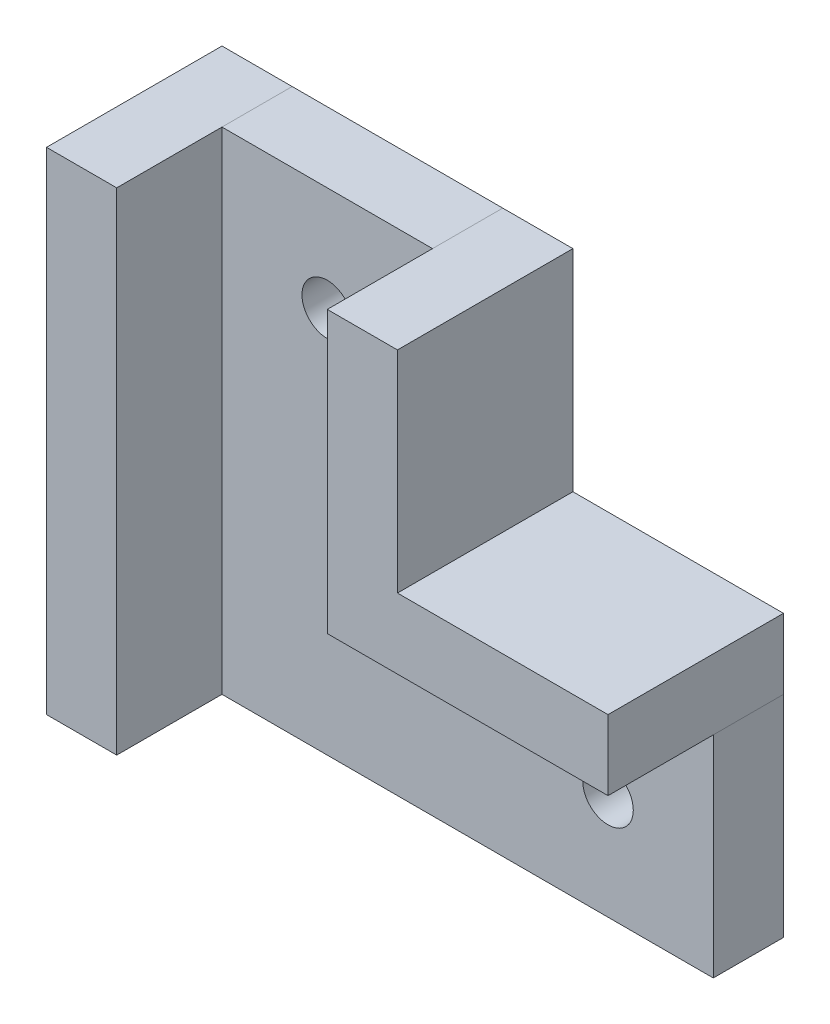
ISO-10303-21;
HEADER;
FILE_DESCRIPTION(('STEP AP214'),'2;1');
FILE_NAME('part.step','',(''),(''),'','','');
FILE_SCHEMA(('AUTOMOTIVE_DESIGN { 1 0 10303 214 1 1 1 1 }'));
ENDSEC;
DATA;
#1=APPLICATION_CONTEXT('core data for automotive mechanical design processes');
#2=APPLICATION_PROTOCOL_DEFINITION('international standard','automotive_design',2000,#1);
#3=PRODUCT_CONTEXT('',#1,'mechanical');
#4=PRODUCT('Part','Part','',(#3));
#5=PRODUCT_RELATED_PRODUCT_CATEGORY('part','',(#4));
#6=PRODUCT_DEFINITION_FORMATION('','',#4);
#7=PRODUCT_DEFINITION_CONTEXT('part definition',#1,'design');
#8=PRODUCT_DEFINITION('design','',#6,#7);
#9=PRODUCT_DEFINITION_SHAPE('','',#8);
#10=(LENGTH_UNIT() NAMED_UNIT(*) SI_UNIT(.MILLI.,.METRE.));
#11=(NAMED_UNIT(*) PLANE_ANGLE_UNIT() SI_UNIT($,.RADIAN.));
#12=(NAMED_UNIT(*) SI_UNIT($,.STERADIAN.) SOLID_ANGLE_UNIT());
#13=UNCERTAINTY_MEASURE_WITH_UNIT(LENGTH_MEASURE(1.E-05),#10,'distance_accuracy_value','');
#14=(GEOMETRIC_REPRESENTATION_CONTEXT(3) GLOBAL_UNCERTAINTY_ASSIGNED_CONTEXT((#13)) GLOBAL_UNIT_ASSIGNED_CONTEXT((#10,
#11,#12)) REPRESENTATION_CONTEXT('',''));
#15=CARTESIAN_POINT('',(0.,0.,0.));
#16=DIRECTION('',(0.,0.,1.));
#17=DIRECTION('',(1.,0.,0.));
#18=AXIS2_PLACEMENT_3D('',#15,#16,#17);
#19=CARTESIAN_POINT('',(-7.52988047808764,-25.8067729083665,12.5));
#20=DIRECTION('',(1.,0.,0.));
#21=DIRECTION('',(0.,1.,0.));
#22=AXIS2_PLACEMENT_3D('',#19,#20,#21);
#23=PLANE('',#22);
#24=DIRECTION('',(0.,-1.,0.));
#25=VECTOR('',#24,1.);
#26=CARTESIAN_POINT('',(-7.52988047808764,-25.8067729083665,0.));
#27=LINE('',#26,#25);
#28=CARTESIAN_POINT('',(-7.52988047808764,9.19322709163348,0.));
#29=VERTEX_POINT('',#28);
#30=CARTESIAN_POINT('',(-7.52988047808764,-25.8067729083665,0.));
#31=VERTEX_POINT('',#30);
#32=EDGE_CURVE('E114',#29,#31,#27,.T.);
#33=ORIENTED_EDGE('',*,*,#32,.F.);
#34=DIRECTION('',(0.,0.,-1.));
#35=VECTOR('',#34,1.);
#36=CARTESIAN_POINT('',(-7.52988047808764,9.19322709163348,12.5));
#37=LINE('',#36,#35);
#38=CARTESIAN_POINT('',(-7.52988047808764,9.19322709163348,12.5));
#39=VERTEX_POINT('',#38);
#40=EDGE_CURVE('E12',#39,#29,#37,.T.);
#41=ORIENTED_EDGE('',*,*,#40,.F.);
#42=DIRECTION('',(0.,-1.,0.));
#43=VECTOR('',#42,1.);
#44=CARTESIAN_POINT('',(-7.52988047808764,-25.8067729083665,12.5));
#45=LINE('',#44,#43);
#46=CARTESIAN_POINT('',(-7.52988047808764,-25.8067729083665,12.5));
#47=VERTEX_POINT('',#46);
#48=EDGE_CURVE('E108',#39,#47,#45,.T.);
#49=ORIENTED_EDGE('',*,*,#48,.T.);
#50=DIRECTION('',(0.,0.,-1.));
#51=VECTOR('',#50,1.);
#52=CARTESIAN_POINT('',(-7.52988047808764,-25.8067729083665,12.5));
#53=LINE('',#52,#51);
#54=EDGE_CURVE('E53',#47,#31,#53,.T.);
#55=ORIENTED_EDGE('',*,*,#54,.T.);
#56=EDGE_LOOP('',(#33,#41,#49,#55));
#57=FACE_BOUND('',#56,.T.);
#58=ADVANCED_FACE('F50',(#57),#23,.T.);
#59=CARTESIAN_POINT('',(-7.52988047808764,9.19322709163348,12.5));
#60=DIRECTION('',(0.,1.,0.));
#61=DIRECTION('',(0.,0.,1.));
#62=AXIS2_PLACEMENT_3D('',#59,#60,#61);
#63=PLANE('',#62);
#64=DIRECTION('',(1.,0.,0.));
#65=VECTOR('',#64,1.);
#66=CARTESIAN_POINT('',(-7.52988047808764,9.19322709163348,0.));
#67=LINE('',#66,#65);
#68=CARTESIAN_POINT('',(-12.5298804780876,9.19322709163348,0.));
#69=VERTEX_POINT('',#68);
#70=EDGE_CURVE('E110',#69,#29,#67,.T.);
#71=ORIENTED_EDGE('',*,*,#70,.F.);
#72=DIRECTION('',(0.,0.,-1.));
#73=VECTOR('',#72,1.);
#74=CARTESIAN_POINT('',(-12.5298804780876,9.19322709163348,12.5));
#75=LINE('',#74,#73);
#76=CARTESIAN_POINT('',(-12.5298804780876,9.19322709163348,12.5));
#77=VERTEX_POINT('',#76);
#78=EDGE_CURVE('E59',#77,#69,#75,.T.);
#79=ORIENTED_EDGE('',*,*,#78,.F.);
#80=DIRECTION('',(1.,0.,0.));
#81=VECTOR('',#80,1.);
#82=CARTESIAN_POINT('',(-7.52988047808764,9.19322709163348,12.5));
#83=LINE('',#82,#81);
#84=EDGE_CURVE('E105',#77,#39,#83,.T.);
#85=ORIENTED_EDGE('',*,*,#84,.T.);
#86=ORIENTED_EDGE('',*,*,#40,.T.);
#87=EDGE_LOOP('',(#71,#79,#85,#86));
#88=FACE_BOUND('',#87,.T.);
#89=ADVANCED_FACE('F124',(#88),#63,.T.);
#90=CARTESIAN_POINT('',(-12.5298804780876,-25.8067729083665,12.5));
#91=DIRECTION('',(-1.,0.,0.));
#92=DIRECTION('',(0.,0.,1.));
#93=AXIS2_PLACEMENT_3D('',#90,#91,#92);
#94=PLANE('',#93);
#95=DIRECTION('',(0.,1.,0.));
#96=VECTOR('',#95,1.);
#97=CARTESIAN_POINT('',(-12.5298804780876,-25.8067729083665,0.));
#98=LINE('',#97,#96);
#99=CARTESIAN_POINT('',(-12.5298804780876,-25.8067729083665,0.));
#100=VERTEX_POINT('',#99);
#101=EDGE_CURVE('E100',#100,#69,#98,.T.);
#102=ORIENTED_EDGE('',*,*,#101,.F.);
#103=DIRECTION('',(0.,0.,-1.));
#104=VECTOR('',#103,1.);
#105=CARTESIAN_POINT('',(-12.5298804780876,-25.8067729083665,12.5));
#106=LINE('',#105,#104);
#107=CARTESIAN_POINT('',(-12.5298804780876,-25.8067729083665,12.5));
#108=VERTEX_POINT('',#107);
#109=EDGE_CURVE('E95',#108,#100,#106,.T.);
#110=ORIENTED_EDGE('',*,*,#109,.F.);
#111=DIRECTION('',(0.,1.,0.));
#112=VECTOR('',#111,1.);
#113=CARTESIAN_POINT('',(-12.5298804780876,-25.8067729083665,12.5));
#114=LINE('',#113,#112);
#115=EDGE_CURVE('E98',#108,#77,#114,.T.);
#116=ORIENTED_EDGE('',*,*,#115,.T.);
#117=ORIENTED_EDGE('',*,*,#78,.T.);
#118=EDGE_LOOP('',(#102,#110,#116,#117));
#119=FACE_BOUND('',#118,.T.);
#120=ADVANCED_FACE('F97',(#119),#94,.T.);
#121=CARTESIAN_POINT('',(-7.52988047808764,-25.8067729083665,12.5));
#122=DIRECTION('',(0.,-1.,0.));
#123=DIRECTION('',(0.,0.,-1.));
#124=AXIS2_PLACEMENT_3D('',#121,#122,#123);
#125=PLANE('',#124);
#126=DIRECTION('',(-1.,0.,0.));
#127=VECTOR('',#126,1.);
#128=CARTESIAN_POINT('',(-7.52988047808764,-25.8067729083665,0.));
#129=LINE('',#128,#127);
#130=EDGE_CURVE('E117',#31,#100,#129,.T.);
#131=ORIENTED_EDGE('',*,*,#130,.F.);
#132=ORIENTED_EDGE('',*,*,#54,.F.);
#133=DIRECTION('',(-1.,0.,0.));
#134=VECTOR('',#133,1.);
#135=CARTESIAN_POINT('',(-7.52988047808764,-25.8067729083665,12.5));
#136=LINE('',#135,#134);
#137=EDGE_CURVE('E104',#47,#108,#136,.T.);
#138=ORIENTED_EDGE('',*,*,#137,.T.);
#139=ORIENTED_EDGE('',*,*,#109,.T.);
#140=EDGE_LOOP('',(#131,#132,#138,#139));
#141=FACE_BOUND('',#140,.T.);
#142=ADVANCED_FACE('F107',(#141),#125,.T.);
#143=CARTESIAN_POINT('',(0.,0.,12.5));
#144=DIRECTION('',(0.,0.,1.));
#145=DIRECTION('',(1.,0.,0.));
#146=AXIS2_PLACEMENT_3D('',#143,#144,#145);
#147=PLANE('',#146);
#148=ORIENTED_EDGE('',*,*,#48,.F.);
#149=ORIENTED_EDGE('',*,*,#84,.F.);
#150=ORIENTED_EDGE('',*,*,#115,.F.);
#151=ORIENTED_EDGE('',*,*,#137,.F.);
#152=EDGE_LOOP('',(#148,#149,#150,#151));
#153=FACE_BOUND('',#152,.T.);
#154=ADVANCED_FACE('F103',(#153),#147,.T.);
#155=CARTESIAN_POINT('',(0.,0.,0.));
#156=DIRECTION('',(0.,0.,1.));
#157=DIRECTION('',(1.,0.,0.));
#158=AXIS2_PLACEMENT_3D('',#155,#156,#157);
#159=PLANE('',#158);
#160=ORIENTED_EDGE('',*,*,#32,.T.);
#161=ORIENTED_EDGE('',*,*,#130,.T.);
#162=ORIENTED_EDGE('',*,*,#101,.T.);
#163=ORIENTED_EDGE('',*,*,#70,.T.);
#164=EDGE_LOOP('',(#160,#161,#162,#163));
#165=FACE_BOUND('',#164,.T.);
#166=ADVANCED_FACE('F123',(#165),#159,.F.);
#167=CLOSED_SHELL('',(#58,#89,#120,#142,#154,#166));
#168=MANIFOLD_SOLID_BREP('B2',#167);
#169=CARTESIAN_POINT('',(7.47011952191236,-10.8067729083665,12.5));
#170=DIRECTION('',(-1.,0.,0.));
#171=DIRECTION('',(0.,-1.,0.));
#172=AXIS2_PLACEMENT_3D('',#169,#170,#171);
#173=PLANE('',#172);
#174=DIRECTION('',(0.,1.,0.));
#175=VECTOR('',#174,1.);
#176=CARTESIAN_POINT('',(7.47011952191236,-10.8067729083665,0.));
#177=LINE('',#176,#175);
#178=CARTESIAN_POINT('',(7.47011952191236,-10.8067729083665,0.));
#179=VERTEX_POINT('',#178);
#180=CARTESIAN_POINT('',(7.47011952191236,9.19322709163348,0.));
#181=VERTEX_POINT('',#180);
#182=EDGE_CURVE('E268',#179,#181,#177,.T.);
#183=ORIENTED_EDGE('',*,*,#182,.F.);
#184=DIRECTION('',(0.,0.,-1.));
#185=VECTOR('',#184,1.);
#186=CARTESIAN_POINT('',(7.47011952191236,-10.8067729083665,12.5));
#187=LINE('',#186,#185);
#188=CARTESIAN_POINT('',(7.47011952191236,-10.8067729083665,12.5));
#189=VERTEX_POINT('',#188);
#190=EDGE_CURVE('E48',#189,#179,#187,.T.);
#191=ORIENTED_EDGE('',*,*,#190,.F.);
#192=DIRECTION('',(0.,1.,0.));
#193=VECTOR('',#192,1.);
#194=CARTESIAN_POINT('',(7.47011952191236,-10.8067729083665,12.5));
#195=LINE('',#194,#193);
#196=CARTESIAN_POINT('',(7.47011952191236,9.19322709163348,12.5));
#197=VERTEX_POINT('',#196);
#198=EDGE_CURVE('E282',#189,#197,#195,.T.);
#199=ORIENTED_EDGE('',*,*,#198,.T.);
#200=DIRECTION('',(0.,0.,-1.));
#201=VECTOR('',#200,1.);
#202=CARTESIAN_POINT('',(7.47011952191236,9.19322709163348,12.5));
#203=LINE('',#202,#201);
#204=EDGE_CURVE('E186',#197,#181,#203,.T.);
#205=ORIENTED_EDGE('',*,*,#204,.T.);
#206=EDGE_LOOP('',(#183,#191,#199,#205));
#207=FACE_BOUND('',#206,.T.);
#208=ADVANCED_FACE('F183',(#207),#173,.T.);
#209=CARTESIAN_POINT('',(27.4701195219124,-10.8067729083665,12.5));
#210=DIRECTION('',(0.,-1.,0.));
#211=DIRECTION('',(1.,0.,0.));
#212=AXIS2_PLACEMENT_3D('',#209,#210,#211);
#213=PLANE('',#212);
#214=DIRECTION('',(-1.,0.,0.));
#215=VECTOR('',#214,1.);
#216=CARTESIAN_POINT('',(27.4701195219124,-10.8067729083665,0.));
#217=LINE('',#216,#215);
#218=CARTESIAN_POINT('',(27.4701195219124,-10.8067729083665,0.));
#219=VERTEX_POINT('',#218);
#220=EDGE_CURVE('E280',#219,#179,#217,.T.);
#221=ORIENTED_EDGE('',*,*,#220,.F.);
#222=DIRECTION('',(0.,0.,-1.));
#223=VECTOR('',#222,1.);
#224=CARTESIAN_POINT('',(27.4701195219124,-10.8067729083665,12.5));
#225=LINE('',#224,#223);
#226=CARTESIAN_POINT('',(27.4701195219124,-10.8067729083665,12.5));
#227=VERTEX_POINT('',#226);
#228=EDGE_CURVE('E192',#227,#219,#225,.T.);
#229=ORIENTED_EDGE('',*,*,#228,.F.);
#230=DIRECTION('',(-1.,0.,0.));
#231=VECTOR('',#230,1.);
#232=CARTESIAN_POINT('',(27.4701195219124,-10.8067729083665,12.5));
#233=LINE('',#232,#231);
#234=EDGE_CURVE('E258',#227,#189,#233,.T.);
#235=ORIENTED_EDGE('',*,*,#234,.T.);
#236=ORIENTED_EDGE('',*,*,#190,.T.);
#237=EDGE_LOOP('',(#221,#229,#235,#236));
#238=FACE_BOUND('',#237,.T.);
#239=ADVANCED_FACE('F290',(#238),#213,.T.);
#240=CARTESIAN_POINT('',(27.4701195219124,-10.8067729083665,12.5));
#241=DIRECTION('',(1.,0.,0.));
#242=DIRECTION('',(0.,0.,-1.));
#243=AXIS2_PLACEMENT_3D('',#240,#241,#242);
#244=PLANE('',#243);
#245=DIRECTION('',(0.,-1.,0.));
#246=VECTOR('',#245,1.);
#247=CARTESIAN_POINT('',(27.4701195219124,-10.8067729083665,0.));
#248=LINE('',#247,#246);
#249=CARTESIAN_POINT('',(27.4701195219124,-5.80677290836653,0.));
#250=VERTEX_POINT('',#249);
#251=EDGE_CURVE('E245',#250,#219,#248,.T.);
#252=ORIENTED_EDGE('',*,*,#251,.F.);
#253=DIRECTION('',(0.,0.,-1.));
#254=VECTOR('',#253,1.);
#255=CARTESIAN_POINT('',(27.4701195219124,-5.80677290836653,12.5));
#256=LINE('',#255,#254);
#257=CARTESIAN_POINT('',(27.4701195219124,-5.80677290836653,12.5));
#258=VERTEX_POINT('',#257);
#259=EDGE_CURVE('E240',#258,#250,#256,.T.);
#260=ORIENTED_EDGE('',*,*,#259,.F.);
#261=DIRECTION('',(0.,-1.,0.));
#262=VECTOR('',#261,1.);
#263=CARTESIAN_POINT('',(27.4701195219124,-10.8067729083665,12.5));
#264=LINE('',#263,#262);
#265=EDGE_CURVE('E243',#258,#227,#264,.T.);
#266=ORIENTED_EDGE('',*,*,#265,.T.);
#267=ORIENTED_EDGE('',*,*,#228,.T.);
#268=EDGE_LOOP('',(#252,#260,#266,#267));
#269=FACE_BOUND('',#268,.T.);
#270=ADVANCED_FACE('F242',(#269),#244,.T.);
#271=CARTESIAN_POINT('',(12.4701195219124,-5.80677290836653,12.5));
#272=DIRECTION('',(0.,1.,0.));
#273=DIRECTION('',(-1.,0.,0.));
#274=AXIS2_PLACEMENT_3D('',#271,#272,#273);
#275=PLANE('',#274);
#276=DIRECTION('',(1.,0.,0.));
#277=VECTOR('',#276,1.);
#278=CARTESIAN_POINT('',(12.4701195219124,-5.80677290836653,0.));
#279=LINE('',#278,#277);
#280=CARTESIAN_POINT('',(12.4701195219124,-5.80677290836653,0.));
#281=VERTEX_POINT('',#280);
#282=EDGE_CURVE('E277',#281,#250,#279,.T.);
#283=ORIENTED_EDGE('',*,*,#282,.F.);
#284=DIRECTION('',(0.,0.,-1.));
#285=VECTOR('',#284,1.);
#286=CARTESIAN_POINT('',(12.4701195219124,-5.80677290836653,12.5));
#287=LINE('',#286,#285);
#288=CARTESIAN_POINT('',(12.4701195219124,-5.80677290836653,12.5));
#289=VERTEX_POINT('',#288);
#290=EDGE_CURVE('E250',#289,#281,#287,.T.);
#291=ORIENTED_EDGE('',*,*,#290,.F.);
#292=DIRECTION('',(1.,0.,0.));
#293=VECTOR('',#292,1.);
#294=CARTESIAN_POINT('',(12.4701195219124,-5.80677290836653,12.5));
#295=LINE('',#294,#293);
#296=EDGE_CURVE('E256',#289,#258,#295,.T.);
#297=ORIENTED_EDGE('',*,*,#296,.T.);
#298=ORIENTED_EDGE('',*,*,#259,.T.);
#299=EDGE_LOOP('',(#283,#291,#297,#298));
#300=FACE_BOUND('',#299,.T.);
#301=ADVANCED_FACE('F260',(#300),#275,.T.);
#302=CARTESIAN_POINT('',(12.4701195219124,9.19322709163348,12.5));
#303=DIRECTION('',(1.,0.,0.));
#304=DIRECTION('',(0.,1.,0.));
#305=AXIS2_PLACEMENT_3D('',#302,#303,#304);
#306=PLANE('',#305);
#307=DIRECTION('',(0.,-1.,0.));
#308=VECTOR('',#307,1.);
#309=CARTESIAN_POINT('',(12.4701195219124,9.19322709163348,0.));
#310=LINE('',#309,#308);
#311=CARTESIAN_POINT('',(12.4701195219124,9.19322709163348,0.));
#312=VERTEX_POINT('',#311);
#313=EDGE_CURVE('E274',#312,#281,#310,.T.);
#314=ORIENTED_EDGE('',*,*,#313,.F.);
#315=DIRECTION('',(0.,0.,-1.));
#316=VECTOR('',#315,1.);
#317=CARTESIAN_POINT('',(12.4701195219124,9.19322709163348,12.5));
#318=LINE('',#317,#316);
#319=CARTESIAN_POINT('',(12.4701195219124,9.19322709163348,12.5));
#320=VERTEX_POINT('',#319);
#321=EDGE_CURVE('E285',#320,#312,#318,.T.);
#322=ORIENTED_EDGE('',*,*,#321,.F.);
#323=DIRECTION('',(0.,-1.,0.));
#324=VECTOR('',#323,1.);
#325=CARTESIAN_POINT('',(12.4701195219124,9.19322709163348,12.5));
#326=LINE('',#325,#324);
#327=EDGE_CURVE('E261',#320,#289,#326,.T.);
#328=ORIENTED_EDGE('',*,*,#327,.T.);
#329=ORIENTED_EDGE('',*,*,#290,.T.);
#330=EDGE_LOOP('',(#314,#322,#328,#329));
#331=FACE_BOUND('',#330,.T.);
#332=ADVANCED_FACE('F303',(#331),#306,.T.);
#333=CARTESIAN_POINT('',(7.47011952191236,9.19322709163348,12.5));
#334=DIRECTION('',(0.,1.,0.));
#335=DIRECTION('',(0.,0.,1.));
#336=AXIS2_PLACEMENT_3D('',#333,#334,#335);
#337=PLANE('',#336);
#338=DIRECTION('',(1.,0.,0.));
#339=VECTOR('',#338,1.);
#340=CARTESIAN_POINT('',(7.47011952191236,9.19322709163348,0.));
#341=LINE('',#340,#339);
#342=EDGE_CURVE('E271',#181,#312,#341,.T.);
#343=ORIENTED_EDGE('',*,*,#342,.F.);
#344=ORIENTED_EDGE('',*,*,#204,.F.);
#345=DIRECTION('',(1.,0.,0.));
#346=VECTOR('',#345,1.);
#347=CARTESIAN_POINT('',(7.47011952191236,9.19322709163348,12.5));
#348=LINE('',#347,#346);
#349=EDGE_CURVE('E263',#197,#320,#348,.T.);
#350=ORIENTED_EDGE('',*,*,#349,.T.);
#351=ORIENTED_EDGE('',*,*,#321,.T.);
#352=EDGE_LOOP('',(#343,#344,#350,#351));
#353=FACE_BOUND('',#352,.T.);
#354=ADVANCED_FACE('F287',(#353),#337,.T.);
#355=CARTESIAN_POINT('',(0.,0.,12.5));
#356=DIRECTION('',(0.,0.,-1.));
#357=DIRECTION('',(-1.,0.,0.));
#358=AXIS2_PLACEMENT_3D('',#355,#356,#357);
#359=PLANE('',#358);
#360=ORIENTED_EDGE('',*,*,#198,.F.);
#361=ORIENTED_EDGE('',*,*,#234,.F.);
#362=ORIENTED_EDGE('',*,*,#265,.F.);
#363=ORIENTED_EDGE('',*,*,#296,.F.);
#364=ORIENTED_EDGE('',*,*,#327,.F.);
#365=ORIENTED_EDGE('',*,*,#349,.F.);
#366=EDGE_LOOP('',(#360,#361,#362,#363,#364,#365));
#367=FACE_BOUND('',#366,.T.);
#368=ADVANCED_FACE('F254',(#367),#359,.F.);
#369=CARTESIAN_POINT('',(0.,0.,0.));
#370=DIRECTION('',(0.,0.,-1.));
#371=DIRECTION('',(-1.,0.,0.));
#372=AXIS2_PLACEMENT_3D('',#369,#370,#371);
#373=PLANE('',#372);
#374=ORIENTED_EDGE('',*,*,#182,.T.);
#375=ORIENTED_EDGE('',*,*,#342,.T.);
#376=ORIENTED_EDGE('',*,*,#313,.T.);
#377=ORIENTED_EDGE('',*,*,#282,.T.);
#378=ORIENTED_EDGE('',*,*,#251,.T.);
#379=ORIENTED_EDGE('',*,*,#220,.T.);
#380=EDGE_LOOP('',(#374,#375,#376,#377,#378,#379));
#381=FACE_BOUND('',#380,.T.);
#382=ADVANCED_FACE('F289',(#381),#373,.T.);
#383=CLOSED_SHELL('',(#208,#239,#270,#301,#332,#354,#368,#382));
#384=MANIFOLD_SOLID_BREP('B6',#383);
#385=CARTESIAN_POINT('',(-7.52988047808764,9.19322709163348,5.));
#386=DIRECTION('',(1.,0.,0.));
#387=DIRECTION('',(0.,1.,0.));
#388=AXIS2_PLACEMENT_3D('',#385,#386,#387);
#389=PLANE('',#388);
#390=DIRECTION('',(0.,-1.,0.));
#391=VECTOR('',#390,1.);
#392=CARTESIAN_POINT('',(-7.52988047808764,9.19322709163348,0.));
#393=LINE('',#392,#391);
#394=CARTESIAN_POINT('',(-7.52988047808764,9.19322709163348,0.));
#395=VERTEX_POINT('',#394);
#396=CARTESIAN_POINT('',(-7.52988047808764,-25.8067729083665,0.));
#397=VERTEX_POINT('',#396);
#398=EDGE_CURVE('E448',#395,#397,#393,.T.);
#399=ORIENTED_EDGE('',*,*,#398,.T.);
#400=DIRECTION('',(0.,0.,-1.));
#401=VECTOR('',#400,1.);
#402=CARTESIAN_POINT('',(-7.52988047808764,-25.8067729083665,5.));
#403=LINE('',#402,#401);
#404=CARTESIAN_POINT('',(-7.52988047808764,-25.8067729083665,5.));
#405=VERTEX_POINT('',#404);
#406=EDGE_CURVE('E181',#405,#397,#403,.T.);
#407=ORIENTED_EDGE('',*,*,#406,.F.);
#408=DIRECTION('',(0.,-1.,0.));
#409=VECTOR('',#408,1.);
#410=CARTESIAN_POINT('',(-7.52988047808764,9.19322709163348,5.));
#411=LINE('',#410,#409);
#412=CARTESIAN_POINT('',(-7.52988047808764,9.19322709163348,5.));
#413=VERTEX_POINT('',#412);
#414=EDGE_CURVE('E465',#413,#405,#411,.T.);
#415=ORIENTED_EDGE('',*,*,#414,.F.);
#416=DIRECTION('',(0.,0.,-1.));
#417=VECTOR('',#416,1.);
#418=CARTESIAN_POINT('',(-7.52988047808764,9.19322709163348,5.));
#419=LINE('',#418,#417);
#420=EDGE_CURVE('E444',#413,#395,#419,.T.);
#421=ORIENTED_EDGE('',*,*,#420,.T.);
#422=EDGE_LOOP('',(#399,#407,#415,#421));
#423=FACE_BOUND('',#422,.T.);
#424=ADVANCED_FACE('F359',(#423),#389,.F.);
#425=CARTESIAN_POINT('',(-7.52988047808764,-25.8067729083665,5.));
#426=DIRECTION('',(0.,1.,0.));
#427=DIRECTION('',(0.,0.,1.));
#428=AXIS2_PLACEMENT_3D('',#425,#426,#427);
#429=PLANE('',#428);
#430=DIRECTION('',(1.,0.,0.));
#431=VECTOR('',#430,1.);
#432=CARTESIAN_POINT('',(-7.52988047808764,-25.8067729083665,0.));
#433=LINE('',#432,#431);
#434=CARTESIAN_POINT('',(27.4701195219124,-25.8067729083665,0.));
#435=VERTEX_POINT('',#434);
#436=EDGE_CURVE('E452',#397,#435,#433,.T.);
#437=ORIENTED_EDGE('',*,*,#436,.T.);
#438=DIRECTION('',(0.,0.,-1.));
#439=VECTOR('',#438,1.);
#440=CARTESIAN_POINT('',(27.4701195219124,-25.8067729083665,5.));
#441=LINE('',#440,#439);
#442=CARTESIAN_POINT('',(27.4701195219124,-25.8067729083665,5.));
#443=VERTEX_POINT('',#442);
#444=EDGE_CURVE('E368',#443,#435,#441,.T.);
#445=ORIENTED_EDGE('',*,*,#444,.F.);
#446=DIRECTION('',(1.,0.,0.));
#447=VECTOR('',#446,1.);
#448=CARTESIAN_POINT('',(-7.52988047808764,-25.8067729083665,5.));
#449=LINE('',#448,#447);
#450=EDGE_CURVE('E413',#405,#443,#449,.T.);
#451=ORIENTED_EDGE('',*,*,#450,.F.);
#452=ORIENTED_EDGE('',*,*,#406,.T.);
#453=EDGE_LOOP('',(#437,#445,#451,#452));
#454=FACE_BOUND('',#453,.T.);
#455=ADVANCED_FACE('F494',(#454),#429,.F.);
#456=CARTESIAN_POINT('',(27.4701195219124,-25.8067729083665,5.));
#457=DIRECTION('',(-1.,0.,0.));
#458=DIRECTION('',(0.,0.,1.));
#459=AXIS2_PLACEMENT_3D('',#456,#457,#458);
#460=PLANE('',#459);
#461=DIRECTION('',(0.,1.,0.));
#462=VECTOR('',#461,1.);
#463=CARTESIAN_POINT('',(27.4701195219124,-25.8067729083665,0.));
#464=LINE('',#463,#462);
#465=CARTESIAN_POINT('',(27.4701195219124,-10.8067729083665,0.));
#466=VERTEX_POINT('',#465);
#467=EDGE_CURVE('E456',#435,#466,#464,.T.);
#468=ORIENTED_EDGE('',*,*,#467,.T.);
#469=DIRECTION('',(0.,0.,-1.));
#470=VECTOR('',#469,1.);
#471=CARTESIAN_POINT('',(27.4701195219124,-10.8067729083665,5.));
#472=LINE('',#471,#470);
#473=CARTESIAN_POINT('',(27.4701195219124,-10.8067729083665,5.));
#474=VERTEX_POINT('',#473);
#475=EDGE_CURVE('E437',#474,#466,#472,.T.);
#476=ORIENTED_EDGE('',*,*,#475,.F.);
#477=DIRECTION('',(0.,1.,0.));
#478=VECTOR('',#477,1.);
#479=CARTESIAN_POINT('',(27.4701195219124,-25.8067729083665,5.));
#480=LINE('',#479,#478);
#481=EDGE_CURVE('E426',#443,#474,#480,.T.);
#482=ORIENTED_EDGE('',*,*,#481,.F.);
#483=ORIENTED_EDGE('',*,*,#444,.T.);
#484=EDGE_LOOP('',(#468,#476,#482,#483));
#485=FACE_BOUND('',#484,.T.);
#486=ADVANCED_FACE('F475',(#485),#460,.F.);
#487=CARTESIAN_POINT('',(27.4701195219124,-10.8067729083665,5.));
#488=DIRECTION('',(0.,-1.,0.));
#489=DIRECTION('',(1.,0.,0.));
#490=AXIS2_PLACEMENT_3D('',#487,#488,#489);
#491=PLANE('',#490);
#492=DIRECTION('',(-1.,0.,0.));
#493=VECTOR('',#492,1.);
#494=CARTESIAN_POINT('',(27.4701195219124,-10.8067729083665,0.));
#495=LINE('',#494,#493);
#496=CARTESIAN_POINT('',(7.47011952191236,-10.8067729083665,0.));
#497=VERTEX_POINT('',#496);
#498=EDGE_CURVE('E435',#466,#497,#495,.T.);
#499=ORIENTED_EDGE('',*,*,#498,.T.);
#500=DIRECTION('',(0.,0.,-1.));
#501=VECTOR('',#500,1.);
#502=CARTESIAN_POINT('',(7.47011952191236,-10.8067729083665,5.));
#503=LINE('',#502,#501);
#504=CARTESIAN_POINT('',(7.47011952191236,-10.8067729083665,5.));
#505=VERTEX_POINT('',#504);
#506=EDGE_CURVE('E432',#505,#497,#503,.T.);
#507=ORIENTED_EDGE('',*,*,#506,.F.);
#508=DIRECTION('',(-1.,0.,0.));
#509=VECTOR('',#508,1.);
#510=CARTESIAN_POINT('',(27.4701195219124,-10.8067729083665,5.));
#511=LINE('',#510,#509);
#512=EDGE_CURVE('E420',#474,#505,#511,.T.);
#513=ORIENTED_EDGE('',*,*,#512,.F.);
#514=ORIENTED_EDGE('',*,*,#475,.T.);
#515=EDGE_LOOP('',(#499,#507,#513,#514));
#516=FACE_BOUND('',#515,.T.);
#517=ADVANCED_FACE('F433',(#516),#491,.F.);
#518=CARTESIAN_POINT('',(7.47011952191236,9.19322709163348,5.));
#519=DIRECTION('',(-1.,0.,0.));
#520=DIRECTION('',(0.,-1.,0.));
#521=AXIS2_PLACEMENT_3D('',#518,#519,#520);
#522=PLANE('',#521);
#523=DIRECTION('',(0.,1.,0.));
#524=VECTOR('',#523,1.);
#525=CARTESIAN_POINT('',(7.47011952191236,9.19322709163348,0.));
#526=LINE('',#525,#524);
#527=CARTESIAN_POINT('',(7.47011952191236,9.19322709163348,0.));
#528=VERTEX_POINT('',#527);
#529=EDGE_CURVE('E399',#497,#528,#526,.T.);
#530=ORIENTED_EDGE('',*,*,#529,.T.);
#531=DIRECTION('',(0.,0.,-1.));
#532=VECTOR('',#531,1.);
#533=CARTESIAN_POINT('',(7.47011952191236,9.19322709163348,5.));
#534=LINE('',#533,#532);
#535=CARTESIAN_POINT('',(7.47011952191236,9.19322709163348,5.));
#536=VERTEX_POINT('',#535);
#537=EDGE_CURVE('E438',#536,#528,#534,.T.);
#538=ORIENTED_EDGE('',*,*,#537,.F.);
#539=DIRECTION('',(0.,1.,0.));
#540=VECTOR('',#539,1.);
#541=CARTESIAN_POINT('',(7.47011952191236,9.19322709163348,5.));
#542=LINE('',#541,#540);
#543=EDGE_CURVE('E424',#505,#536,#542,.T.);
#544=ORIENTED_EDGE('',*,*,#543,.F.);
#545=ORIENTED_EDGE('',*,*,#506,.T.);
#546=EDGE_LOOP('',(#530,#538,#544,#545));
#547=FACE_BOUND('',#546,.T.);
#548=ADVANCED_FACE('F440',(#547),#522,.F.);
#549=CARTESIAN_POINT('',(-7.52988047808764,9.19322709163348,5.));
#550=DIRECTION('',(0.,-1.,0.));
#551=DIRECTION('',(0.,0.,-1.));
#552=AXIS2_PLACEMENT_3D('',#549,#550,#551);
#553=PLANE('',#552);
#554=DIRECTION('',(-1.,0.,0.));
#555=VECTOR('',#554,1.);
#556=CARTESIAN_POINT('',(-7.52988047808764,9.19322709163348,0.));
#557=LINE('',#556,#555);
#558=EDGE_CURVE('E405',#528,#395,#557,.T.);
#559=ORIENTED_EDGE('',*,*,#558,.T.);
#560=ORIENTED_EDGE('',*,*,#420,.F.);
#561=DIRECTION('',(-1.,0.,0.));
#562=VECTOR('',#561,1.);
#563=CARTESIAN_POINT('',(-7.52988047808764,9.19322709163348,5.));
#564=LINE('',#563,#562);
#565=EDGE_CURVE('E376',#536,#413,#564,.T.);
#566=ORIENTED_EDGE('',*,*,#565,.F.);
#567=ORIENTED_EDGE('',*,*,#537,.T.);
#568=EDGE_LOOP('',(#559,#560,#566,#567));
#569=FACE_BOUND('',#568,.T.);
#570=ADVANCED_FACE('F482',(#569),#553,.F.);
#571=CARTESIAN_POINT('',(0.,0.,5.));
#572=DIRECTION('',(0.,0.,1.));
#573=DIRECTION('',(1.,0.,0.));
#574=AXIS2_PLACEMENT_3D('',#571,#572,#573);
#575=PLANE('',#574);
#576=CARTESIAN_POINT('',(-0.0298804780876419,1.69322709163348,5.));
#577=DIRECTION('',(0.,0.,1.));
#578=DIRECTION('',(1.,0.,0.));
#579=AXIS2_PLACEMENT_3D('',#576,#577,#578);
#580=CIRCLE('',#579,1.8);
#581=CARTESIAN_POINT('',(1.77011952191236,1.69322709163348,5.));
#582=VERTEX_POINT('',#581);
#583=EDGE_CURVE('E453',#582,#582,#580,.T.);
#584=ORIENTED_EDGE('',*,*,#583,.F.);
#585=EDGE_LOOP('',(#584));
#586=FACE_BOUND('',#585,.T.);
#587=CARTESIAN_POINT('',(19.9701195219124,-18.3067729083665,5.));
#588=DIRECTION('',(0.,0.,1.));
#589=DIRECTION('',(1.,0.,0.));
#590=AXIS2_PLACEMENT_3D('',#587,#588,#589);
#591=CIRCLE('',#590,1.8);
#592=CARTESIAN_POINT('',(21.7701195219124,-18.3067729083665,5.));
#593=VERTEX_POINT('',#592);
#594=EDGE_CURVE('E561',#593,#593,#591,.T.);
#595=ORIENTED_EDGE('',*,*,#594,.F.);
#596=EDGE_LOOP('',(#595));
#597=FACE_BOUND('',#596,.T.);
#598=ORIENTED_EDGE('',*,*,#414,.T.);
#599=ORIENTED_EDGE('',*,*,#450,.T.);
#600=ORIENTED_EDGE('',*,*,#481,.T.);
#601=ORIENTED_EDGE('',*,*,#512,.T.);
#602=ORIENTED_EDGE('',*,*,#543,.T.);
#603=ORIENTED_EDGE('',*,*,#565,.T.);
#604=EDGE_LOOP('',(#598,#599,#600,#601,#602,#603));
#605=FACE_BOUND('',#604,.T.);
#606=ADVANCED_FACE('F422',(#586,#597,#605),#575,.T.);
#607=CARTESIAN_POINT('',(0.,0.,0.));
#608=DIRECTION('',(0.,0.,1.));
#609=DIRECTION('',(1.,0.,0.));
#610=AXIS2_PLACEMENT_3D('',#607,#608,#609);
#611=PLANE('',#610);
#612=CARTESIAN_POINT('',(-0.0298804780876419,1.69322709163348,0.));
#613=DIRECTION('',(0.,0.,-1.));
#614=DIRECTION('',(-1.,0.,0.));
#615=AXIS2_PLACEMENT_3D('',#612,#613,#614);
#616=CIRCLE('',#615,1.8);
#617=CARTESIAN_POINT('',(-1.82988047808764,1.69322709163348,0.));
#618=VERTEX_POINT('',#617);
#619=EDGE_CURVE('E559',#618,#618,#616,.T.);
#620=ORIENTED_EDGE('',*,*,#619,.F.);
#621=EDGE_LOOP('',(#620));
#622=FACE_BOUND('',#621,.T.);
#623=CARTESIAN_POINT('',(19.9701195219124,-18.3067729083665,0.));
#624=DIRECTION('',(0.,0.,-1.));
#625=DIRECTION('',(-1.,0.,0.));
#626=AXIS2_PLACEMENT_3D('',#623,#624,#625);
#627=CIRCLE('',#626,1.8);
#628=CARTESIAN_POINT('',(18.1701195219124,-18.3067729083665,0.));
#629=VERTEX_POINT('',#628);
#630=EDGE_CURVE('E562',#629,#629,#627,.T.);
#631=ORIENTED_EDGE('',*,*,#630,.F.);
#632=EDGE_LOOP('',(#631));
#633=FACE_BOUND('',#632,.T.);
#634=ORIENTED_EDGE('',*,*,#398,.F.);
#635=ORIENTED_EDGE('',*,*,#558,.F.);
#636=ORIENTED_EDGE('',*,*,#529,.F.);
#637=ORIENTED_EDGE('',*,*,#498,.F.);
#638=ORIENTED_EDGE('',*,*,#467,.F.);
#639=ORIENTED_EDGE('',*,*,#436,.F.);
#640=EDGE_LOOP('',(#634,#635,#636,#637,#638,#639));
#641=FACE_BOUND('',#640,.T.);
#642=ADVANCED_FACE('F478',(#622,#633,#641),#611,.F.);
#643=CARTESIAN_POINT('',(19.9701195219124,-18.3067729083665,12.5));
#644=DIRECTION('',(0.,0.,-1.));
#645=DIRECTION('',(-1.,0.,0.));
#646=AXIS2_PLACEMENT_3D('',#643,#644,#645);
#647=CYLINDRICAL_SURFACE('',#646,1.8);
#648=ORIENTED_EDGE('',*,*,#594,.T.);
#649=EDGE_LOOP('',(#648));
#650=FACE_BOUND('',#649,.T.);
#651=ORIENTED_EDGE('',*,*,#630,.T.);
#652=EDGE_LOOP('',(#651));
#653=FACE_BOUND('',#652,.T.);
#654=ADVANCED_FACE('F531',(#650,#653),#647,.F.);
#655=CARTESIAN_POINT('',(-0.0298804780876419,1.69322709163348,12.5));
#656=DIRECTION('',(0.,0.,-1.));
#657=DIRECTION('',(-1.,0.,0.));
#658=AXIS2_PLACEMENT_3D('',#655,#656,#657);
#659=CYLINDRICAL_SURFACE('',#658,1.8);
#660=ORIENTED_EDGE('',*,*,#583,.T.);
#661=EDGE_LOOP('',(#660));
#662=FACE_BOUND('',#661,.T.);
#663=ORIENTED_EDGE('',*,*,#619,.T.);
#664=EDGE_LOOP('',(#663));
#665=FACE_BOUND('',#664,.T.);
#666=ADVANCED_FACE('F540',(#662,#665),#659,.F.);
#667=CLOSED_SHELL('',(#424,#455,#486,#517,#548,#570,#606,#642,#654,#666));
#668=MANIFOLD_SOLID_BREP('B42',#667);
#669=ADVANCED_BREP_SHAPE_REPRESENTATION('',(#18,#168,#384,#668),#14);
#670=SHAPE_DEFINITION_REPRESENTATION(#9,#669);
ENDSEC;
END-ISO-10303-21;
